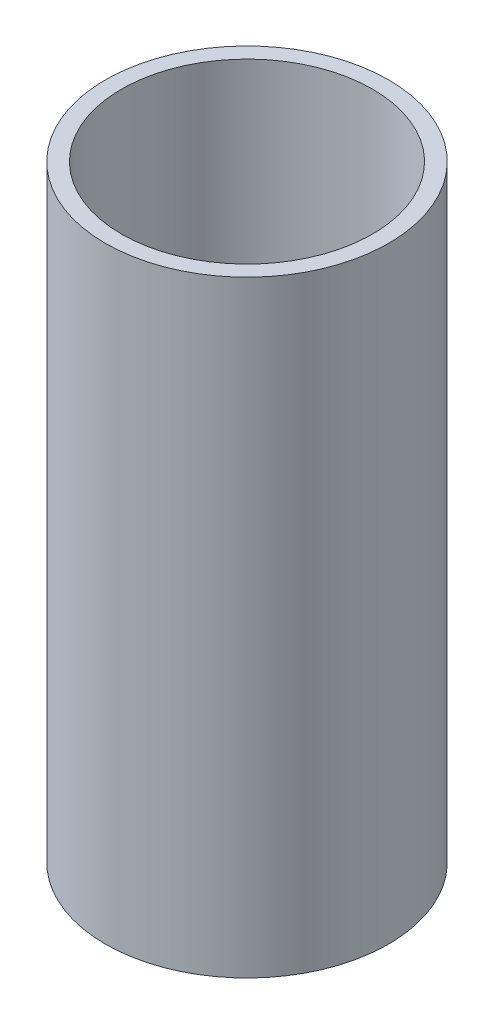
ISO-10303-21;
HEADER;
FILE_DESCRIPTION(('STEP AP214'),'2;1');
FILE_NAME('part.step','',(''),(''),'','','');
FILE_SCHEMA(('AUTOMOTIVE_DESIGN { 1 0 10303 214 1 1 1 1 }'));
ENDSEC;
DATA;
#1=APPLICATION_CONTEXT('core data for automotive mechanical design processes');
#2=APPLICATION_PROTOCOL_DEFINITION('international standard','automotive_design',2000,#1);
#3=PRODUCT_CONTEXT('',#1,'mechanical');
#4=PRODUCT('Part','Part','',(#3));
#5=PRODUCT_RELATED_PRODUCT_CATEGORY('part','',(#4));
#6=PRODUCT_DEFINITION_FORMATION('','',#4);
#7=PRODUCT_DEFINITION_CONTEXT('part definition',#1,'design');
#8=PRODUCT_DEFINITION('design','',#6,#7);
#9=PRODUCT_DEFINITION_SHAPE('','',#8);
#10=(LENGTH_UNIT() NAMED_UNIT(*) SI_UNIT(.MILLI.,.METRE.));
#11=(NAMED_UNIT(*) PLANE_ANGLE_UNIT() SI_UNIT($,.RADIAN.));
#12=(NAMED_UNIT(*) SI_UNIT($,.STERADIAN.) SOLID_ANGLE_UNIT());
#13=UNCERTAINTY_MEASURE_WITH_UNIT(LENGTH_MEASURE(1.E-05),#10,'distance_accuracy_value','');
#14=(GEOMETRIC_REPRESENTATION_CONTEXT(3) GLOBAL_UNCERTAINTY_ASSIGNED_CONTEXT((#13)) GLOBAL_UNIT_ASSIGNED_CONTEXT((#10,
#11,#12)) REPRESENTATION_CONTEXT('',''));
#15=CARTESIAN_POINT('',(0.,0.,0.));
#16=DIRECTION('',(0.,0.,1.));
#17=DIRECTION('',(1.,0.,0.));
#18=AXIS2_PLACEMENT_3D('',#15,#16,#17);
#19=CARTESIAN_POINT('',(0.,257.15848944626,0.));
#20=DIRECTION('',(0.,-1.,0.));
#21=DIRECTION('',(0.,0.,-1.));
#22=AXIS2_PLACEMENT_3D('',#19,#20,#21);
#23=CYLINDRICAL_SURFACE('',#22,60.);
#24=CARTESIAN_POINT('',(0.,257.15848944626,0.));
#25=DIRECTION('',(0.,1.,0.));
#26=DIRECTION('',(0.,0.,1.));
#27=AXIS2_PLACEMENT_3D('',#24,#25,#26);
#28=CIRCLE('',#27,60.);
#29=CARTESIAN_POINT('',(0.,257.15848944626,60.));
#30=VERTEX_POINT('',#29);
#31=EDGE_CURVE('E10',#30,#30,#28,.T.);
#32=ORIENTED_EDGE('',*,*,#31,.F.);
#33=EDGE_LOOP('',(#32));
#34=FACE_BOUND('',#33,.T.);
#35=CARTESIAN_POINT('',(0.,0.,0.));
#36=DIRECTION('',(0.,1.,0.));
#37=DIRECTION('',(0.,0.,1.));
#38=AXIS2_PLACEMENT_3D('',#35,#36,#37);
#39=CIRCLE('',#38,60.);
#40=CARTESIAN_POINT('',(0.,0.,60.));
#41=VERTEX_POINT('',#40);
#42=EDGE_CURVE('E37',#41,#41,#39,.T.);
#43=ORIENTED_EDGE('',*,*,#42,.T.);
#44=EDGE_LOOP('',(#43));
#45=FACE_BOUND('',#44,.T.);
#46=ADVANCED_FACE('F40',(#34,#45),#23,.T.);
#47=CARTESIAN_POINT('',(0.,257.15848944626,0.));
#48=DIRECTION('',(0.,1.,0.));
#49=DIRECTION('',(0.,0.,1.));
#50=AXIS2_PLACEMENT_3D('',#47,#48,#49);
#51=PLANE('',#50);
#52=CARTESIAN_POINT('',(0.,257.15848944626,0.));
#53=DIRECTION('',(0.,1.,0.));
#54=DIRECTION('',(0.,0.,1.));
#55=AXIS2_PLACEMENT_3D('',#52,#53,#54);
#56=CIRCLE('',#55,53.2018470633979);
#57=CARTESIAN_POINT('',(0.,257.15848944626,53.2018470633979));
#58=VERTEX_POINT('',#57);
#59=EDGE_CURVE('E50',#58,#58,#56,.T.);
#60=ORIENTED_EDGE('',*,*,#59,.F.);
#61=EDGE_LOOP('',(#60));
#62=FACE_BOUND('',#61,.T.);
#63=ORIENTED_EDGE('',*,*,#31,.T.);
#64=EDGE_LOOP('',(#63));
#65=FACE_BOUND('',#64,.T.);
#66=ADVANCED_FACE('F59',(#62,#65),#51,.T.);
#67=CARTESIAN_POINT('',(0.,0.,0.));
#68=DIRECTION('',(0.,1.,0.));
#69=DIRECTION('',(0.,0.,1.));
#70=AXIS2_PLACEMENT_3D('',#67,#68,#69);
#71=PLANE('',#70);
#72=CARTESIAN_POINT('',(0.,0.,0.));
#73=DIRECTION('',(0.,1.,0.));
#74=DIRECTION('',(0.,0.,1.));
#75=AXIS2_PLACEMENT_3D('',#72,#73,#74);
#76=CIRCLE('',#75,53.2018470633979);
#77=CARTESIAN_POINT('',(0.,0.,53.2018470633979));
#78=VERTEX_POINT('',#77);
#79=EDGE_CURVE('E47',#78,#78,#76,.T.);
#80=ORIENTED_EDGE('',*,*,#79,.T.);
#81=EDGE_LOOP('',(#80));
#82=FACE_BOUND('',#81,.T.);
#83=ORIENTED_EDGE('',*,*,#42,.F.);
#84=EDGE_LOOP('',(#83));
#85=FACE_BOUND('',#84,.T.);
#86=ADVANCED_FACE('F58',(#82,#85),#71,.F.);
#87=CARTESIAN_POINT('',(0.,257.15848944626,0.));
#88=DIRECTION('',(0.,-1.,0.));
#89=DIRECTION('',(0.,0.,-1.));
#90=AXIS2_PLACEMENT_3D('',#87,#88,#89);
#91=CYLINDRICAL_SURFACE('',#90,53.2018470633979);
#92=ORIENTED_EDGE('',*,*,#59,.T.);
#93=EDGE_LOOP('',(#92));
#94=FACE_BOUND('',#93,.T.);
#95=ORIENTED_EDGE('',*,*,#79,.F.);
#96=EDGE_LOOP('',(#95));
#97=FACE_BOUND('',#96,.T.);
#98=ADVANCED_FACE('F54',(#94,#97),#91,.F.);
#99=CLOSED_SHELL('',(#46,#66,#86,#98));
#100=MANIFOLD_SOLID_BREP('B2',#99);
#101=ADVANCED_BREP_SHAPE_REPRESENTATION('',(#18,#100),#14);
#102=SHAPE_DEFINITION_REPRESENTATION(#9,#101);
ENDSEC;
END-ISO-10303-21;
